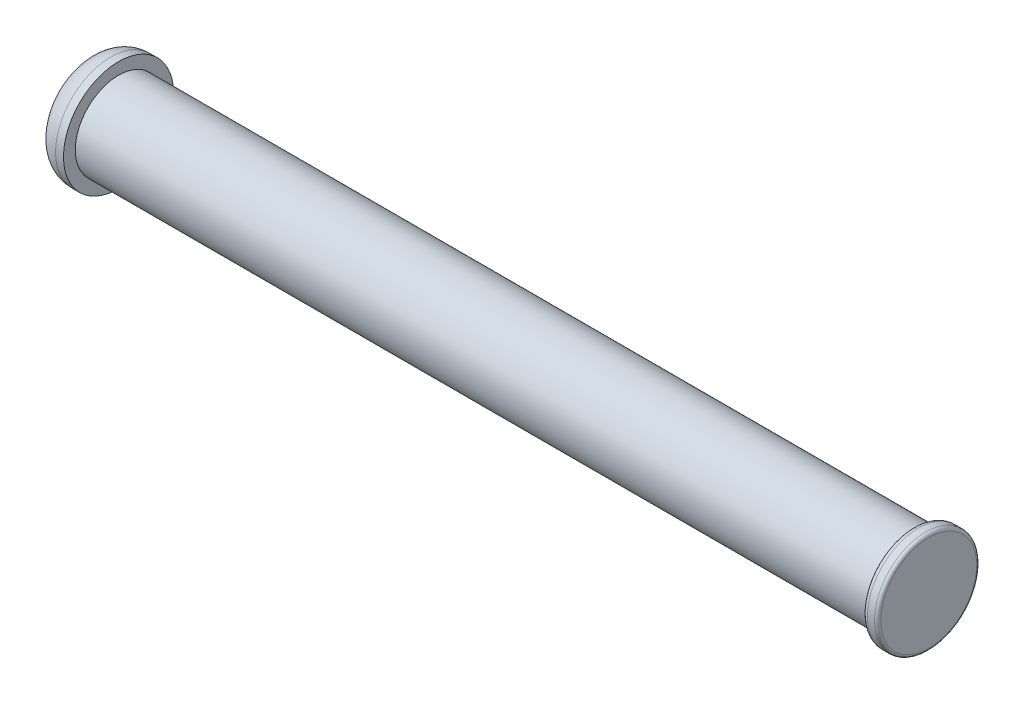
ISO-10303-21;
HEADER;
FILE_DESCRIPTION(('STEP AP214'),'2;1');
FILE_NAME('part.step','',(''),(''),'','','');
FILE_SCHEMA(('AUTOMOTIVE_DESIGN { 1 0 10303 214 1 1 1 1 }'));
ENDSEC;
DATA;
#1=APPLICATION_CONTEXT('core data for automotive mechanical design processes');
#2=APPLICATION_PROTOCOL_DEFINITION('international standard','automotive_design',2000,#1);
#3=PRODUCT_CONTEXT('',#1,'mechanical');
#4=PRODUCT('Part','Part','',(#3));
#5=PRODUCT_RELATED_PRODUCT_CATEGORY('part','',(#4));
#6=PRODUCT_DEFINITION_FORMATION('','',#4);
#7=PRODUCT_DEFINITION_CONTEXT('part definition',#1,'design');
#8=PRODUCT_DEFINITION('design','',#6,#7);
#9=PRODUCT_DEFINITION_SHAPE('','',#8);
#10=(LENGTH_UNIT() NAMED_UNIT(*) SI_UNIT(.MILLI.,.METRE.));
#11=(NAMED_UNIT(*) PLANE_ANGLE_UNIT() SI_UNIT($,.RADIAN.));
#12=(NAMED_UNIT(*) SI_UNIT($,.STERADIAN.) SOLID_ANGLE_UNIT());
#13=UNCERTAINTY_MEASURE_WITH_UNIT(LENGTH_MEASURE(1.E-05),#10,'distance_accuracy_value','');
#14=(GEOMETRIC_REPRESENTATION_CONTEXT(3) GLOBAL_UNCERTAINTY_ASSIGNED_CONTEXT((#13)) GLOBAL_UNIT_ASSIGNED_CONTEXT((#10,
#11,#12)) REPRESENTATION_CONTEXT('',''));
#15=CARTESIAN_POINT('',(0.,0.,0.));
#16=DIRECTION('',(0.,0.,1.));
#17=DIRECTION('',(1.,0.,0.));
#18=AXIS2_PLACEMENT_3D('',#15,#16,#17);
#19=CARTESIAN_POINT('',(2.,0.,0.));
#20=DIRECTION('',(-1.,0.,0.));
#21=DIRECTION('',(0.,0.,1.));
#22=AXIS2_PLACEMENT_3D('',#19,#20,#21);
#23=CYLINDRICAL_SURFACE('',#22,3.5);
#24=CARTESIAN_POINT('',(1.5,0.,0.));
#25=DIRECTION('',(1.,0.,0.));
#26=DIRECTION('',(0.,0.,-1.));
#27=AXIS2_PLACEMENT_3D('',#24,#25,#26);
#28=CIRCLE('',#27,3.5);
#29=CARTESIAN_POINT('',(1.5,0.,-3.5));
#30=VERTEX_POINT('',#29);
#31=EDGE_CURVE('E55',#30,#30,#28,.T.);
#32=ORIENTED_EDGE('',*,*,#31,.T.);
#33=EDGE_LOOP('',(#32));
#34=FACE_BOUND('',#33,.T.);
#35=CARTESIAN_POINT('',(2.,0.,0.));
#36=DIRECTION('',(1.,0.,0.));
#37=DIRECTION('',(0.,0.,-1.));
#38=AXIS2_PLACEMENT_3D('',#35,#36,#37);
#39=CIRCLE('',#38,3.5);
#40=CARTESIAN_POINT('',(2.,0.,-3.5));
#41=VERTEX_POINT('',#40);
#42=EDGE_CURVE('E59',#41,#41,#39,.T.);
#43=ORIENTED_EDGE('',*,*,#42,.F.);
#44=EDGE_LOOP('',(#43));
#45=FACE_BOUND('',#44,.T.);
#46=ADVANCED_FACE('F32',(#34,#45),#23,.T.);
#47=CARTESIAN_POINT('',(2.,0.,0.));
#48=DIRECTION('',(1.,0.,0.));
#49=DIRECTION('',(0.,0.,-1.));
#50=AXIS2_PLACEMENT_3D('',#47,#48,#49);
#51=PLANE('',#50);
#52=CARTESIAN_POINT('',(2.,0.,0.));
#53=DIRECTION('',(1.,0.,0.));
#54=DIRECTION('',(0.,0.,-1.));
#55=AXIS2_PLACEMENT_3D('',#52,#53,#54);
#56=CIRCLE('',#55,2.75);
#57=CARTESIAN_POINT('',(2.,0.,-2.75));
#58=VERTEX_POINT('',#57);
#59=EDGE_CURVE('E58',#58,#58,#56,.T.);
#60=ORIENTED_EDGE('',*,*,#59,.F.);
#61=EDGE_LOOP('',(#60));
#62=FACE_BOUND('',#61,.T.);
#63=ORIENTED_EDGE('',*,*,#42,.T.);
#64=EDGE_LOOP('',(#63));
#65=FACE_BOUND('',#64,.T.);
#66=ADVANCED_FACE('F78',(#62,#65),#51,.T.);
#67=CARTESIAN_POINT('',(0.,0.,0.));
#68=DIRECTION('',(1.,0.,0.));
#69=DIRECTION('',(0.,0.,-1.));
#70=AXIS2_PLACEMENT_3D('',#67,#68,#69);
#71=PLANE('',#70);
#72=CARTESIAN_POINT('',(0.,0.,0.));
#73=DIRECTION('',(1.,0.,0.));
#74=DIRECTION('',(0.,0.,-1.));
#75=AXIS2_PLACEMENT_3D('',#72,#73,#74);
#76=CIRCLE('',#75,2.);
#77=CARTESIAN_POINT('',(0.,0.,-2.));
#78=VERTEX_POINT('',#77);
#79=EDGE_CURVE('E52',#78,#78,#76,.F.);
#80=ORIENTED_EDGE('',*,*,#79,.T.);
#81=EDGE_LOOP('',(#80));
#82=FACE_BOUND('',#81,.T.);
#83=ADVANCED_FACE('F74',(#82),#71,.F.);
#84=CARTESIAN_POINT('',(52.5,0.,0.));
#85=DIRECTION('',(-1.,0.,0.));
#86=DIRECTION('',(0.,0.,1.));
#87=AXIS2_PLACEMENT_3D('',#84,#85,#86);
#88=CYLINDRICAL_SURFACE('',#87,2.75);
#89=CARTESIAN_POINT('',(52.5,0.,0.));
#90=DIRECTION('',(1.,0.,0.));
#91=DIRECTION('',(0.,0.,-1.));
#92=AXIS2_PLACEMENT_3D('',#89,#90,#91);
#93=CIRCLE('',#92,2.75);
#94=CARTESIAN_POINT('',(52.5,0.,-2.75));
#95=VERTEX_POINT('',#94);
#96=EDGE_CURVE('E62',#95,#95,#93,.T.);
#97=ORIENTED_EDGE('',*,*,#96,.F.);
#98=EDGE_LOOP('',(#97));
#99=FACE_BOUND('',#98,.T.);
#100=ORIENTED_EDGE('',*,*,#59,.T.);
#101=EDGE_LOOP('',(#100));
#102=FACE_BOUND('',#101,.T.);
#103=ADVANCED_FACE('F70',(#99,#102),#88,.T.);
#104=CARTESIAN_POINT('',(53.5,0.,0.));
#105=DIRECTION('',(-1.,0.,0.));
#106=DIRECTION('',(0.,0.,1.));
#107=AXIS2_PLACEMENT_3D('',#104,#105,#106);
#108=CYLINDRICAL_SURFACE('',#107,3.25);
#109=CARTESIAN_POINT('',(53.3,0.,0.));
#110=DIRECTION('',(1.,0.,0.));
#111=DIRECTION('',(0.,0.,-1.));
#112=AXIS2_PLACEMENT_3D('',#109,#110,#111);
#113=CIRCLE('',#112,3.25);
#114=CARTESIAN_POINT('',(53.3,0.,-3.25));
#115=VERTEX_POINT('',#114);
#116=EDGE_CURVE('E10',#115,#115,#113,.F.);
#117=ORIENTED_EDGE('',*,*,#116,.T.);
#118=EDGE_LOOP('',(#117));
#119=FACE_BOUND('',#118,.T.);
#120=CARTESIAN_POINT('',(52.85,0.,0.));
#121=DIRECTION('',(1.,0.,0.));
#122=DIRECTION('',(0.,0.,-1.));
#123=AXIS2_PLACEMENT_3D('',#120,#121,#122);
#124=CIRCLE('',#123,3.25);
#125=CARTESIAN_POINT('',(52.85,0.,-3.25));
#126=VERTEX_POINT('',#125);
#127=EDGE_CURVE('E47',#126,#126,#124,.T.);
#128=ORIENTED_EDGE('',*,*,#127,.T.);
#129=EDGE_LOOP('',(#128));
#130=FACE_BOUND('',#129,.T.);
#131=ADVANCED_FACE('F73',(#119,#130),#108,.T.);
#132=CARTESIAN_POINT('',(53.5,0.,0.));
#133=DIRECTION('',(1.,0.,0.));
#134=DIRECTION('',(0.,0.,-1.));
#135=AXIS2_PLACEMENT_3D('',#132,#133,#134);
#136=PLANE('',#135);
#137=CARTESIAN_POINT('',(53.5,0.,0.));
#138=DIRECTION('',(1.,0.,0.));
#139=DIRECTION('',(0.,0.,-1.));
#140=AXIS2_PLACEMENT_3D('',#137,#138,#139);
#141=CIRCLE('',#140,3.05);
#142=CARTESIAN_POINT('',(53.5,0.,-3.05));
#143=VERTEX_POINT('',#142);
#144=EDGE_CURVE('E39',#143,#143,#141,.T.);
#145=ORIENTED_EDGE('',*,*,#144,.T.);
#146=EDGE_LOOP('',(#145));
#147=FACE_BOUND('',#146,.T.);
#148=ADVANCED_FACE('F106',(#147),#136,.T.);
#149=CARTESIAN_POINT('',(52.5,0.,0.));
#150=DIRECTION('',(1.,0.,0.));
#151=DIRECTION('',(0.,0.,-1.));
#152=AXIS2_PLACEMENT_3D('',#149,#150,#151);
#153=PLANE('',#152);
#154=CARTESIAN_POINT('',(52.5,0.,0.));
#155=DIRECTION('',(1.,0.,0.));
#156=DIRECTION('',(0.,0.,-1.));
#157=AXIS2_PLACEMENT_3D('',#154,#155,#156);
#158=CIRCLE('',#157,2.9);
#159=CARTESIAN_POINT('',(52.5,0.,-2.9));
#160=VERTEX_POINT('',#159);
#161=EDGE_CURVE('E43',#160,#160,#158,.F.);
#162=ORIENTED_EDGE('',*,*,#161,.T.);
#163=EDGE_LOOP('',(#162));
#164=FACE_BOUND('',#163,.T.);
#165=ORIENTED_EDGE('',*,*,#96,.T.);
#166=EDGE_LOOP('',(#165));
#167=FACE_BOUND('',#166,.T.);
#168=ADVANCED_FACE('F68',(#164,#167),#153,.F.);
#169=CARTESIAN_POINT('',(1.5,0.,0.));
#170=DIRECTION('',(1.,0.,0.));
#171=DIRECTION('',(0.,0.,-1.));
#172=AXIS2_PLACEMENT_3D('',#169,#170,#171);
#173=TOROIDAL_SURFACE('',#172,2.,1.5);
#174=ORIENTED_EDGE('',*,*,#79,.F.);
#175=EDGE_LOOP('',(#174));
#176=FACE_BOUND('',#175,.T.);
#177=ORIENTED_EDGE('',*,*,#31,.F.);
#178=EDGE_LOOP('',(#177));
#179=FACE_BOUND('',#178,.T.);
#180=ADVANCED_FACE('F91',(#176,#179),#173,.T.);
#181=CARTESIAN_POINT('',(52.85,0.,0.));
#182=DIRECTION('',(1.,0.,0.));
#183=DIRECTION('',(0.,0.,-1.));
#184=AXIS2_PLACEMENT_3D('',#181,#182,#183);
#185=TOROIDAL_SURFACE('',#184,2.9,0.35);
#186=ORIENTED_EDGE('',*,*,#161,.F.);
#187=EDGE_LOOP('',(#186));
#188=FACE_BOUND('',#187,.T.);
#189=ORIENTED_EDGE('',*,*,#127,.F.);
#190=EDGE_LOOP('',(#189));
#191=FACE_BOUND('',#190,.T.);
#192=ADVANCED_FACE('F93',(#188,#191),#185,.T.);
#193=CARTESIAN_POINT('',(53.3,0.,0.));
#194=DIRECTION('',(1.,0.,0.));
#195=DIRECTION('',(0.,0.,-1.));
#196=AXIS2_PLACEMENT_3D('',#193,#194,#195);
#197=TOROIDAL_SURFACE('',#196,3.05,0.2);
#198=ORIENTED_EDGE('',*,*,#116,.F.);
#199=EDGE_LOOP('',(#198));
#200=FACE_BOUND('',#199,.T.);
#201=ORIENTED_EDGE('',*,*,#144,.F.);
#202=EDGE_LOOP('',(#201));
#203=FACE_BOUND('',#202,.T.);
#204=ADVANCED_FACE('F34',(#200,#203),#197,.T.);
#205=CLOSED_SHELL('',(#46,#66,#83,#103,#131,#148,#168,#180,#192,#204));
#206=MANIFOLD_SOLID_BREP('B2',#205);
#207=ADVANCED_BREP_SHAPE_REPRESENTATION('',(#18,#206),#14);
#208=SHAPE_DEFINITION_REPRESENTATION(#9,#207);
ENDSEC;
END-ISO-10303-21;
